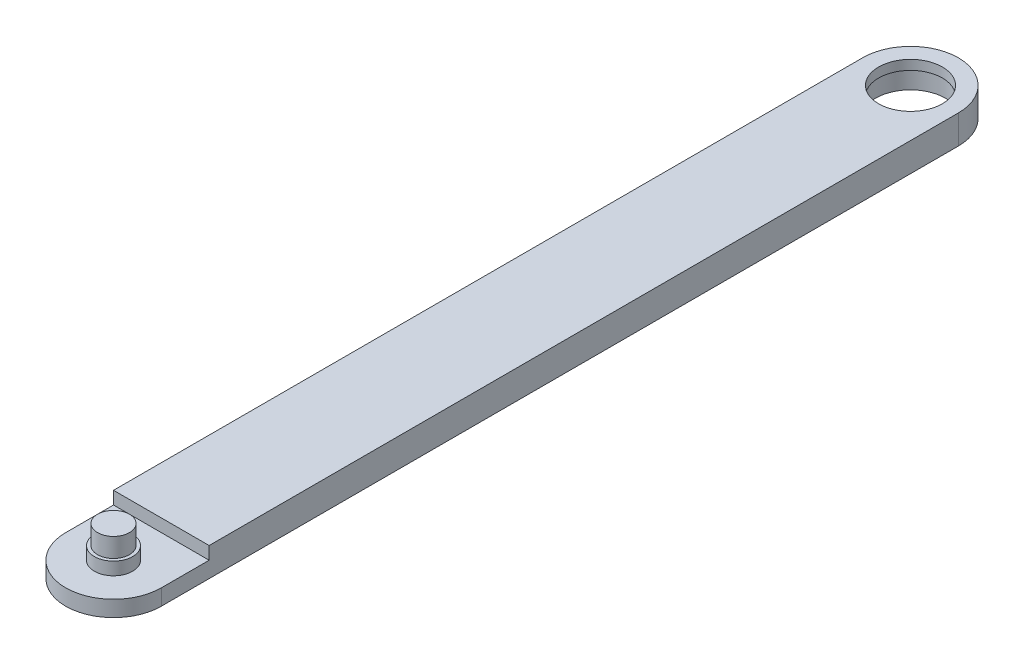
ISO-10303-21;
HEADER;
FILE_DESCRIPTION(('STEP AP214'),'2;1');
FILE_NAME('part.step','',(''),(''),'','','');
FILE_SCHEMA(('AUTOMOTIVE_DESIGN { 1 0 10303 214 1 1 1 1 }'));
ENDSEC;
DATA;
#1=APPLICATION_CONTEXT('core data for automotive mechanical design processes');
#2=APPLICATION_PROTOCOL_DEFINITION('international standard','automotive_design',2000,#1);
#3=PRODUCT_CONTEXT('',#1,'mechanical');
#4=PRODUCT('Part','Part','',(#3));
#5=PRODUCT_RELATED_PRODUCT_CATEGORY('part','',(#4));
#6=PRODUCT_DEFINITION_FORMATION('','',#4);
#7=PRODUCT_DEFINITION_CONTEXT('part definition',#1,'design');
#8=PRODUCT_DEFINITION('design','',#6,#7);
#9=PRODUCT_DEFINITION_SHAPE('','',#8);
#10=(LENGTH_UNIT() NAMED_UNIT(*) SI_UNIT(.MILLI.,.METRE.));
#11=(NAMED_UNIT(*) PLANE_ANGLE_UNIT() SI_UNIT($,.RADIAN.));
#12=(NAMED_UNIT(*) SI_UNIT($,.STERADIAN.) SOLID_ANGLE_UNIT());
#13=UNCERTAINTY_MEASURE_WITH_UNIT(LENGTH_MEASURE(1.E-05),#10,'distance_accuracy_value','');
#14=(GEOMETRIC_REPRESENTATION_CONTEXT(3) GLOBAL_UNCERTAINTY_ASSIGNED_CONTEXT((#13)) GLOBAL_UNIT_ASSIGNED_CONTEXT((#10,
#11,#12)) REPRESENTATION_CONTEXT('',''));
#15=CARTESIAN_POINT('',(0.,0.,0.));
#16=DIRECTION('',(0.,0.,1.));
#17=DIRECTION('',(1.,0.,0.));
#18=AXIS2_PLACEMENT_3D('',#15,#16,#17);
#19=CARTESIAN_POINT('',(0.,10.,250.));
#20=DIRECTION('',(0.,-1.,0.));
#21=DIRECTION('',(0.,0.,-1.));
#22=AXIS2_PLACEMENT_3D('',#19,#20,#21);
#23=CYLINDRICAL_SURFACE('',#22,15.);
#24=DIRECTION('',(0.,-1.,0.));
#25=VECTOR('',#24,1.);
#26=CARTESIAN_POINT('',(15.,10.,250.));
#27=LINE('',#26,#25);
#28=CARTESIAN_POINT('',(15.,6.,250.));
#29=VERTEX_POINT('',#28);
#30=CARTESIAN_POINT('',(15.,1.,250.));
#31=VERTEX_POINT('',#30);
#32=EDGE_CURVE('E116',#29,#31,#27,.T.);
#33=ORIENTED_EDGE('',*,*,#32,.F.);
#34=CARTESIAN_POINT('',(0.,6.,250.));
#35=DIRECTION('',(0.,-1.,0.));
#36=DIRECTION('',(0.,0.,-1.));
#37=AXIS2_PLACEMENT_3D('',#34,#35,#36);
#38=CIRCLE('',#37,15.);
#39=CARTESIAN_POINT('',(-15.,6.,250.));
#40=VERTEX_POINT('',#39);
#41=EDGE_CURVE('E84',#29,#40,#38,.T.);
#42=ORIENTED_EDGE('',*,*,#41,.T.);
#43=DIRECTION('',(0.,-1.,0.));
#44=VECTOR('',#43,1.);
#45=CARTESIAN_POINT('',(-15.,10.,250.));
#46=LINE('',#45,#44);
#47=CARTESIAN_POINT('',(-15.,1.,250.));
#48=VERTEX_POINT('',#47);
#49=EDGE_CURVE('E78',#40,#48,#46,.T.);
#50=ORIENTED_EDGE('',*,*,#49,.T.);
#51=CARTESIAN_POINT('',(0.,1.,250.));
#52=DIRECTION('',(0.,1.,0.));
#53=DIRECTION('',(0.,0.,1.));
#54=AXIS2_PLACEMENT_3D('',#51,#52,#53);
#55=CIRCLE('',#54,15.);
#56=EDGE_CURVE('E82',#48,#31,#55,.T.);
#57=ORIENTED_EDGE('',*,*,#56,.T.);
#58=EDGE_LOOP('',(#33,#42,#50,#57));
#59=FACE_BOUND('',#58,.T.);
#60=ADVANCED_FACE('F33',(#59),#23,.T.);
#61=CARTESIAN_POINT('',(15.,10.,250.));
#62=DIRECTION('',(-1.,0.,0.));
#63=DIRECTION('',(0.,0.,1.));
#64=AXIS2_PLACEMENT_3D('',#61,#62,#63);
#65=PLANE('',#64);
#66=DIRECTION('',(0.,0.,-1.));
#67=VECTOR('',#66,1.);
#68=CARTESIAN_POINT('',(15.,10.,250.));
#69=LINE('',#68,#67);
#70=CARTESIAN_POINT('',(15.,10.,235.));
#71=VERTEX_POINT('',#70);
#72=CARTESIAN_POINT('',(15.,10.,0.));
#73=VERTEX_POINT('',#72);
#74=EDGE_CURVE('E98',#71,#73,#69,.T.);
#75=ORIENTED_EDGE('',*,*,#74,.F.);
#76=DIRECTION('',(0.,1.,0.));
#77=VECTOR('',#76,1.);
#78=CARTESIAN_POINT('',(15.,6.,235.));
#79=LINE('',#78,#77);
#80=CARTESIAN_POINT('',(15.,6.,235.));
#81=VERTEX_POINT('',#80);
#82=EDGE_CURVE('E49',#81,#71,#79,.T.);
#83=ORIENTED_EDGE('',*,*,#82,.F.);
#84=DIRECTION('',(0.,0.,-1.));
#85=VECTOR('',#84,1.);
#86=CARTESIAN_POINT('',(15.,6.,265.));
#87=LINE('',#86,#85);
#88=EDGE_CURVE('E141',#29,#81,#87,.T.);
#89=ORIENTED_EDGE('',*,*,#88,.F.);
#90=ORIENTED_EDGE('',*,*,#32,.T.);
#91=DIRECTION('',(0.,0.,-1.));
#92=VECTOR('',#91,1.);
#93=CARTESIAN_POINT('',(15.,1.,250.));
#94=LINE('',#93,#92);
#95=CARTESIAN_POINT('',(15.,1.,0.));
#96=VERTEX_POINT('',#95);
#97=EDGE_CURVE('E103',#31,#96,#94,.T.);
#98=ORIENTED_EDGE('',*,*,#97,.T.);
#99=DIRECTION('',(0.,-1.,0.));
#100=VECTOR('',#99,1.);
#101=CARTESIAN_POINT('',(15.,10.,0.));
#102=LINE('',#101,#100);
#103=EDGE_CURVE('E113',#73,#96,#102,.T.);
#104=ORIENTED_EDGE('',*,*,#103,.F.);
#105=EDGE_LOOP('',(#75,#83,#89,#90,#98,#104));
#106=FACE_BOUND('',#105,.T.);
#107=ADVANCED_FACE('F166',(#106),#65,.F.);
#108=CARTESIAN_POINT('',(0.,10.,0.));
#109=DIRECTION('',(0.,-1.,0.));
#110=DIRECTION('',(0.,0.,-1.));
#111=AXIS2_PLACEMENT_3D('',#108,#109,#110);
#112=CYLINDRICAL_SURFACE('',#111,15.);
#113=CARTESIAN_POINT('',(0.,1.,0.));
#114=DIRECTION('',(0.,1.,0.));
#115=DIRECTION('',(0.,0.,1.));
#116=AXIS2_PLACEMENT_3D('',#113,#114,#115);
#117=CIRCLE('',#116,15.);
#118=CARTESIAN_POINT('',(-15.,1.,0.));
#119=VERTEX_POINT('',#118);
#120=EDGE_CURVE('E99',#96,#119,#117,.T.);
#121=ORIENTED_EDGE('',*,*,#120,.T.);
#122=DIRECTION('',(0.,-1.,0.));
#123=VECTOR('',#122,1.);
#124=CARTESIAN_POINT('',(-15.,10.,0.));
#125=LINE('',#124,#123);
#126=CARTESIAN_POINT('',(-15.,10.,0.));
#127=VERTEX_POINT('',#126);
#128=EDGE_CURVE('E88',#127,#119,#125,.T.);
#129=ORIENTED_EDGE('',*,*,#128,.F.);
#130=CARTESIAN_POINT('',(0.,10.,0.));
#131=DIRECTION('',(0.,1.,0.));
#132=DIRECTION('',(0.,0.,1.));
#133=AXIS2_PLACEMENT_3D('',#130,#131,#132);
#134=CIRCLE('',#133,15.);
#135=EDGE_CURVE('E58',#73,#127,#134,.T.);
#136=ORIENTED_EDGE('',*,*,#135,.F.);
#137=ORIENTED_EDGE('',*,*,#103,.T.);
#138=EDGE_LOOP('',(#121,#129,#136,#137));
#139=FACE_BOUND('',#138,.T.);
#140=ADVANCED_FACE('F170',(#139),#112,.T.);
#141=CARTESIAN_POINT('',(-15.,10.,0.));
#142=DIRECTION('',(1.,0.,0.));
#143=DIRECTION('',(0.,0.,-1.));
#144=AXIS2_PLACEMENT_3D('',#141,#142,#143);
#145=PLANE('',#144);
#146=DIRECTION('',(0.,0.,1.));
#147=VECTOR('',#146,1.);
#148=CARTESIAN_POINT('',(-15.,6.,265.));
#149=LINE('',#148,#147);
#150=CARTESIAN_POINT('',(-15.,6.,235.));
#151=VERTEX_POINT('',#150);
#152=EDGE_CURVE('E139',#151,#40,#149,.T.);
#153=ORIENTED_EDGE('',*,*,#152,.F.);
#154=DIRECTION('',(0.,1.,0.));
#155=VECTOR('',#154,1.);
#156=CARTESIAN_POINT('',(-15.,6.,235.));
#157=LINE('',#156,#155);
#158=CARTESIAN_POINT('',(-15.,10.,235.));
#159=VERTEX_POINT('',#158);
#160=EDGE_CURVE('E106',#151,#159,#157,.T.);
#161=ORIENTED_EDGE('',*,*,#160,.T.);
#162=DIRECTION('',(0.,0.,1.));
#163=VECTOR('',#162,1.);
#164=CARTESIAN_POINT('',(-15.,10.,0.));
#165=LINE('',#164,#163);
#166=EDGE_CURVE('E89',#127,#159,#165,.T.);
#167=ORIENTED_EDGE('',*,*,#166,.F.);
#168=ORIENTED_EDGE('',*,*,#128,.T.);
#169=DIRECTION('',(0.,0.,1.));
#170=VECTOR('',#169,1.);
#171=CARTESIAN_POINT('',(-15.,1.,0.));
#172=LINE('',#171,#170);
#173=EDGE_CURVE('E93',#119,#48,#172,.T.);
#174=ORIENTED_EDGE('',*,*,#173,.T.);
#175=ORIENTED_EDGE('',*,*,#49,.F.);
#176=EDGE_LOOP('',(#153,#161,#167,#168,#174,#175));
#177=FACE_BOUND('',#176,.T.);
#178=ADVANCED_FACE('F94',(#177),#145,.F.);
#179=CARTESIAN_POINT('',(0.,10.,250.));
#180=DIRECTION('',(0.,1.,0.));
#181=DIRECTION('',(0.,0.,1.));
#182=AXIS2_PLACEMENT_3D('',#179,#180,#181);
#183=PLANE('',#182);
#184=CARTESIAN_POINT('',(0.,10.,0.));
#185=DIRECTION('',(0.,1.,0.));
#186=DIRECTION('',(0.,0.,1.));
#187=AXIS2_PLACEMENT_3D('',#184,#185,#186);
#188=CIRCLE('',#187,10.);
#189=CARTESIAN_POINT('',(0.,10.,10.));
#190=VERTEX_POINT('',#189);
#191=EDGE_CURVE('E36',#190,#190,#188,.T.);
#192=ORIENTED_EDGE('',*,*,#191,.F.);
#193=EDGE_LOOP('',(#192));
#194=FACE_BOUND('',#193,.T.);
#195=DIRECTION('',(-1.,0.,0.));
#196=VECTOR('',#195,1.);
#197=CARTESIAN_POINT('',(-15.,10.,235.));
#198=LINE('',#197,#196);
#199=EDGE_CURVE('E138',#71,#159,#198,.T.);
#200=ORIENTED_EDGE('',*,*,#199,.F.);
#201=ORIENTED_EDGE('',*,*,#74,.T.);
#202=ORIENTED_EDGE('',*,*,#135,.T.);
#203=ORIENTED_EDGE('',*,*,#166,.T.);
#204=EDGE_LOOP('',(#200,#201,#202,#203));
#205=FACE_BOUND('',#204,.T.);
#206=ADVANCED_FACE('F152',(#194,#205),#183,.T.);
#207=CARTESIAN_POINT('',(0.,1.,250.));
#208=DIRECTION('',(0.,1.,0.));
#209=DIRECTION('',(0.,0.,1.));
#210=AXIS2_PLACEMENT_3D('',#207,#208,#209);
#211=PLANE('',#210);
#212=CARTESIAN_POINT('',(0.,1.,0.));
#213=DIRECTION('',(0.,1.,0.));
#214=DIRECTION('',(0.,0.,1.));
#215=AXIS2_PLACEMENT_3D('',#212,#213,#214);
#216=CIRCLE('',#215,11.);
#217=CARTESIAN_POINT('',(0.,1.,11.));
#218=VERTEX_POINT('',#217);
#219=EDGE_CURVE('E119',#218,#218,#216,.T.);
#220=ORIENTED_EDGE('',*,*,#219,.T.);
#221=EDGE_LOOP('',(#220));
#222=FACE_BOUND('',#221,.T.);
#223=ORIENTED_EDGE('',*,*,#56,.F.);
#224=ORIENTED_EDGE('',*,*,#173,.F.);
#225=ORIENTED_EDGE('',*,*,#120,.F.);
#226=ORIENTED_EDGE('',*,*,#97,.F.);
#227=EDGE_LOOP('',(#223,#224,#225,#226));
#228=FACE_BOUND('',#227,.T.);
#229=ADVANCED_FACE('F102',(#222,#228),#211,.F.);
#230=CARTESIAN_POINT('',(0.,6.,0.));
#231=DIRECTION('',(0.,-1.,0.));
#232=DIRECTION('',(0.,0.,-1.));
#233=AXIS2_PLACEMENT_3D('',#230,#231,#232);
#234=PLANE('',#233);
#235=CARTESIAN_POINT('',(0.,6.,250.));
#236=DIRECTION('',(0.,-1.,0.));
#237=DIRECTION('',(0.,0.,-1.));
#238=AXIS2_PLACEMENT_3D('',#235,#236,#237);
#239=CIRCLE('',#238,6.);
#240=CARTESIAN_POINT('',(0.,6.,244.));
#241=VERTEX_POINT('',#240);
#242=EDGE_CURVE('E41',#241,#241,#239,.F.);
#243=ORIENTED_EDGE('',*,*,#242,.F.);
#244=EDGE_LOOP('',(#243));
#245=FACE_BOUND('',#244,.T.);
#246=ORIENTED_EDGE('',*,*,#88,.T.);
#247=DIRECTION('',(-1.,0.,0.));
#248=VECTOR('',#247,1.);
#249=CARTESIAN_POINT('',(-15.,6.,235.));
#250=LINE('',#249,#248);
#251=EDGE_CURVE('E144',#81,#151,#250,.T.);
#252=ORIENTED_EDGE('',*,*,#251,.T.);
#253=ORIENTED_EDGE('',*,*,#152,.T.);
#254=ORIENTED_EDGE('',*,*,#41,.F.);
#255=EDGE_LOOP('',(#246,#252,#253,#254));
#256=FACE_BOUND('',#255,.T.);
#257=ADVANCED_FACE('F162',(#245,#256),#234,.F.);
#258=CARTESIAN_POINT('',(-15.,6.,235.));
#259=DIRECTION('',(0.,0.,-1.));
#260=DIRECTION('',(-1.,0.,0.));
#261=AXIS2_PLACEMENT_3D('',#258,#259,#260);
#262=PLANE('',#261);
#263=ORIENTED_EDGE('',*,*,#199,.T.);
#264=ORIENTED_EDGE('',*,*,#160,.F.);
#265=ORIENTED_EDGE('',*,*,#251,.F.);
#266=ORIENTED_EDGE('',*,*,#82,.T.);
#267=EDGE_LOOP('',(#263,#264,#265,#266));
#268=FACE_BOUND('',#267,.T.);
#269=ADVANCED_FACE('F158',(#268),#262,.F.);
#270=CARTESIAN_POINT('',(0.,10.,250.));
#271=DIRECTION('',(0.,-1.,0.));
#272=DIRECTION('',(0.,0.,-1.));
#273=AXIS2_PLACEMENT_3D('',#270,#271,#272);
#274=CYLINDRICAL_SURFACE('',#273,6.);
#275=CARTESIAN_POINT('',(0.,10.,250.));
#276=DIRECTION('',(0.,1.,0.));
#277=DIRECTION('',(0.,0.,1.));
#278=AXIS2_PLACEMENT_3D('',#275,#276,#277);
#279=CIRCLE('',#278,6.);
#280=CARTESIAN_POINT('',(0.,10.,256.));
#281=VERTEX_POINT('',#280);
#282=EDGE_CURVE('E126',#281,#281,#279,.T.);
#283=ORIENTED_EDGE('',*,*,#282,.F.);
#284=EDGE_LOOP('',(#283));
#285=FACE_BOUND('',#284,.T.);
#286=ORIENTED_EDGE('',*,*,#242,.T.);
#287=EDGE_LOOP('',(#286));
#288=FACE_BOUND('',#287,.T.);
#289=ADVANCED_FACE('F203',(#285,#288),#274,.T.);
#290=CARTESIAN_POINT('',(0.,10.,250.));
#291=DIRECTION('',(0.,1.,0.));
#292=DIRECTION('',(0.,0.,1.));
#293=AXIS2_PLACEMENT_3D('',#290,#291,#292);
#294=PLANE('',#293);
#295=CARTESIAN_POINT('',(0.,10.,250.));
#296=DIRECTION('',(0.,1.,0.));
#297=DIRECTION('',(0.,0.,1.));
#298=AXIS2_PLACEMENT_3D('',#295,#296,#297);
#299=CIRCLE('',#298,5.);
#300=CARTESIAN_POINT('',(0.,10.,255.));
#301=VERTEX_POINT('',#300);
#302=EDGE_CURVE('E11',#301,#301,#299,.T.);
#303=ORIENTED_EDGE('',*,*,#302,.F.);
#304=EDGE_LOOP('',(#303));
#305=FACE_BOUND('',#304,.T.);
#306=ORIENTED_EDGE('',*,*,#282,.T.);
#307=EDGE_LOOP('',(#306));
#308=FACE_BOUND('',#307,.T.);
#309=ADVANCED_FACE('F223',(#305,#308),#294,.T.);
#310=CARTESIAN_POINT('',(0.,16.,250.));
#311=DIRECTION('',(0.,-1.,0.));
#312=DIRECTION('',(0.,0.,-1.));
#313=AXIS2_PLACEMENT_3D('',#310,#311,#312);
#314=CYLINDRICAL_SURFACE('',#313,5.);
#315=CARTESIAN_POINT('',(0.,16.,250.));
#316=DIRECTION('',(0.,1.,0.));
#317=DIRECTION('',(0.,0.,1.));
#318=AXIS2_PLACEMENT_3D('',#315,#316,#317);
#319=CIRCLE('',#318,5.);
#320=CARTESIAN_POINT('',(0.,16.,255.));
#321=VERTEX_POINT('',#320);
#322=EDGE_CURVE('E121',#321,#321,#319,.T.);
#323=ORIENTED_EDGE('',*,*,#322,.F.);
#324=EDGE_LOOP('',(#323));
#325=FACE_BOUND('',#324,.T.);
#326=ORIENTED_EDGE('',*,*,#302,.T.);
#327=EDGE_LOOP('',(#326));
#328=FACE_BOUND('',#327,.T.);
#329=ADVANCED_FACE('F233',(#325,#328),#314,.T.);
#330=CARTESIAN_POINT('',(0.,16.,250.));
#331=DIRECTION('',(0.,1.,0.));
#332=DIRECTION('',(0.,0.,1.));
#333=AXIS2_PLACEMENT_3D('',#330,#331,#332);
#334=PLANE('',#333);
#335=ORIENTED_EDGE('',*,*,#322,.T.);
#336=EDGE_LOOP('',(#335));
#337=FACE_BOUND('',#336,.T.);
#338=ADVANCED_FACE('F243',(#337),#334,.T.);
#339=CARTESIAN_POINT('',(0.,7.,0.));
#340=DIRECTION('',(0.,-1.,0.));
#341=DIRECTION('',(0.,0.,-1.));
#342=AXIS2_PLACEMENT_3D('',#339,#340,#341);
#343=CYLINDRICAL_SURFACE('',#342,11.);
#344=CARTESIAN_POINT('',(0.,7.,0.));
#345=DIRECTION('',(0.,-1.,0.));
#346=DIRECTION('',(0.,0.,-1.));
#347=AXIS2_PLACEMENT_3D('',#344,#345,#346);
#348=CIRCLE('',#347,11.);
#349=CARTESIAN_POINT('',(0.,7.,-11.));
#350=VERTEX_POINT('',#349);
#351=EDGE_CURVE('E122',#350,#350,#348,.T.);
#352=ORIENTED_EDGE('',*,*,#351,.F.);
#353=EDGE_LOOP('',(#352));
#354=FACE_BOUND('',#353,.T.);
#355=ORIENTED_EDGE('',*,*,#219,.F.);
#356=EDGE_LOOP('',(#355));
#357=FACE_BOUND('',#356,.T.);
#358=ADVANCED_FACE('F253',(#354,#357),#343,.F.);
#359=CARTESIAN_POINT('',(0.,7.,0.));
#360=DIRECTION('',(0.,-1.,0.));
#361=DIRECTION('',(0.,0.,-1.));
#362=AXIS2_PLACEMENT_3D('',#359,#360,#361);
#363=PLANE('',#362);
#364=CARTESIAN_POINT('',(0.,7.,0.));
#365=DIRECTION('',(0.,-1.,0.));
#366=DIRECTION('',(0.,0.,-1.));
#367=AXIS2_PLACEMENT_3D('',#364,#365,#366);
#368=CIRCLE('',#367,10.);
#369=CARTESIAN_POINT('',(0.,7.,-10.));
#370=VERTEX_POINT('',#369);
#371=EDGE_CURVE('E133',#370,#370,#368,.T.);
#372=ORIENTED_EDGE('',*,*,#371,.F.);
#373=EDGE_LOOP('',(#372));
#374=FACE_BOUND('',#373,.T.);
#375=ORIENTED_EDGE('',*,*,#351,.T.);
#376=EDGE_LOOP('',(#375));
#377=FACE_BOUND('',#376,.T.);
#378=ADVANCED_FACE('F269',(#374,#377),#363,.T.);
#379=CARTESIAN_POINT('',(0.,16.,0.));
#380=DIRECTION('',(0.,-1.,0.));
#381=DIRECTION('',(0.,0.,-1.));
#382=AXIS2_PLACEMENT_3D('',#379,#380,#381);
#383=CYLINDRICAL_SURFACE('',#382,10.);
#384=ORIENTED_EDGE('',*,*,#191,.T.);
#385=EDGE_LOOP('',(#384));
#386=FACE_BOUND('',#385,.T.);
#387=ORIENTED_EDGE('',*,*,#371,.T.);
#388=EDGE_LOOP('',(#387));
#389=FACE_BOUND('',#388,.T.);
#390=ADVANCED_FACE('F286',(#386,#389),#383,.F.);
#391=CLOSED_SHELL('',(#60,#107,#140,#178,#206,#229,#257,#269,#289,#309,#329,#338,#358,#378,#390));
#392=MANIFOLD_SOLID_BREP('B2',#391);
#393=ADVANCED_BREP_SHAPE_REPRESENTATION('',(#18,#392),#14);
#394=SHAPE_DEFINITION_REPRESENTATION(#9,#393);
ENDSEC;
END-ISO-10303-21;
